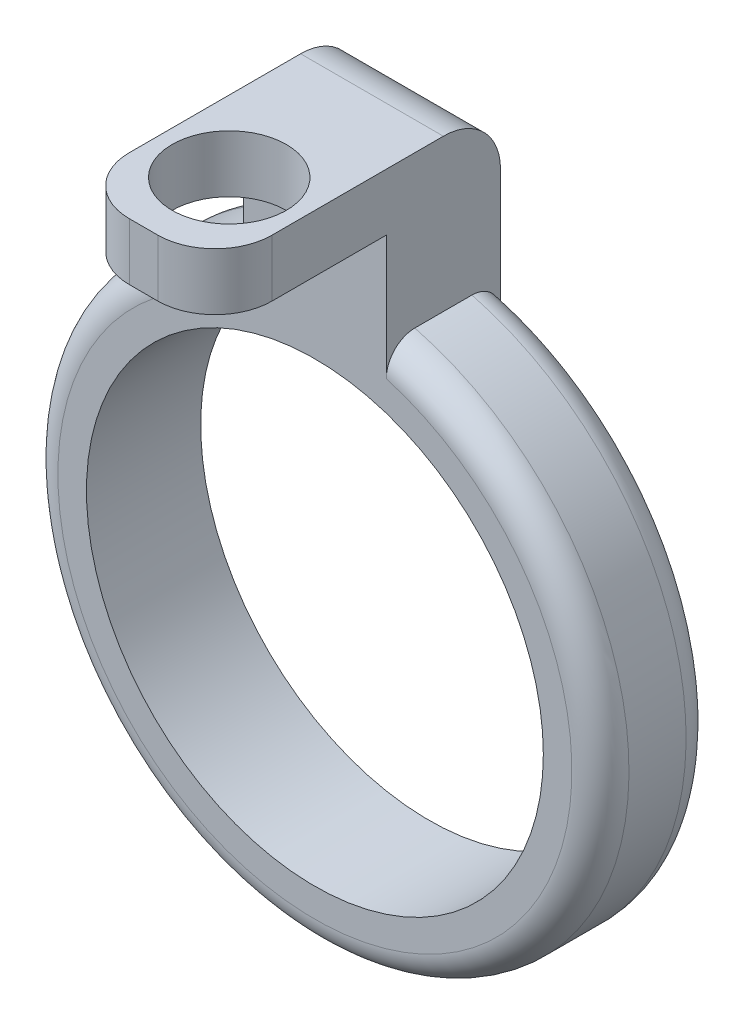
ISO-10303-21;
HEADER;
FILE_DESCRIPTION(('STEP AP214'),'2;1');
FILE_NAME('part.step','',(''),(''),'','','');
FILE_SCHEMA(('AUTOMOTIVE_DESIGN { 1 0 10303 214 1 1 1 1 }'));
ENDSEC;
DATA;
#1=APPLICATION_CONTEXT('core data for automotive mechanical design processes');
#2=APPLICATION_PROTOCOL_DEFINITION('international standard','automotive_design',2000,#1);
#3=PRODUCT_CONTEXT('',#1,'mechanical');
#4=PRODUCT('Part','Part','',(#3));
#5=PRODUCT_RELATED_PRODUCT_CATEGORY('part','',(#4));
#6=PRODUCT_DEFINITION_FORMATION('','',#4);
#7=PRODUCT_DEFINITION_CONTEXT('part definition',#1,'design');
#8=PRODUCT_DEFINITION('design','',#6,#7);
#9=PRODUCT_DEFINITION_SHAPE('','',#8);
#10=(LENGTH_UNIT() NAMED_UNIT(*) SI_UNIT(.MILLI.,.METRE.));
#11=(NAMED_UNIT(*) PLANE_ANGLE_UNIT() SI_UNIT($,.RADIAN.));
#12=(NAMED_UNIT(*) SI_UNIT($,.STERADIAN.) SOLID_ANGLE_UNIT());
#13=UNCERTAINTY_MEASURE_WITH_UNIT(LENGTH_MEASURE(1.E-05),#10,'distance_accuracy_value','');
#14=(GEOMETRIC_REPRESENTATION_CONTEXT(3) GLOBAL_UNCERTAINTY_ASSIGNED_CONTEXT((#13)) GLOBAL_UNIT_ASSIGNED_CONTEXT((#10,
#11,#12)) REPRESENTATION_CONTEXT('',''));
#15=CARTESIAN_POINT('',(0.,0.,0.));
#16=DIRECTION('',(0.,0.,1.));
#17=DIRECTION('',(1.,0.,0.));
#18=AXIS2_PLACEMENT_3D('',#15,#16,#17);
#19=CARTESIAN_POINT('',(-261.777043848484,-270.,10.));
#20=DIRECTION('',(0.,0.,-1.));
#21=DIRECTION('',(-1.,0.,0.));
#22=AXIS2_PLACEMENT_3D('',#19,#20,#21);
#23=CYLINDRICAL_SURFACE('',#22,50.);
#24=DIRECTION('',(0.,0.,-1.));
#25=VECTOR('',#24,1.);
#26=CARTESIAN_POINT('',(-274.277043848484,-221.587708172407,10.));
#27=LINE('',#26,#25);
#28=CARTESIAN_POINT('',(-274.277043848484,-221.587708172407,5.));
#29=VERTEX_POINT('',#28);
#30=CARTESIAN_POINT('',(-274.277043848484,-221.587708172407,-5.));
#31=VERTEX_POINT('',#30);
#32=EDGE_CURVE('E161',#29,#31,#27,.T.);
#33=ORIENTED_EDGE('',*,*,#32,.T.);
#34=CARTESIAN_POINT('',(-261.777043848484,-270.,-5.));
#35=DIRECTION('',(0.,0.,1.));
#36=DIRECTION('',(1.,0.,0.));
#37=AXIS2_PLACEMENT_3D('',#34,#35,#36);
#38=CIRCLE('',#37,50.);
#39=CARTESIAN_POINT('',(-249.277043848484,-221.587708172407,-5.));
#40=VERTEX_POINT('',#39);
#41=EDGE_CURVE('E205',#31,#40,#38,.T.);
#42=ORIENTED_EDGE('',*,*,#41,.T.);
#43=DIRECTION('',(0.,0.,-1.));
#44=VECTOR('',#43,1.);
#45=CARTESIAN_POINT('',(-249.277043848484,-221.587708172407,10.));
#46=LINE('',#45,#44);
#47=CARTESIAN_POINT('',(-249.277043848484,-221.587708172407,5.));
#48=VERTEX_POINT('',#47);
#49=EDGE_CURVE('E160',#40,#48,#46,.F.);
#50=ORIENTED_EDGE('',*,*,#49,.T.);
#51=CARTESIAN_POINT('',(-261.777043848484,-270.,5.));
#52=DIRECTION('',(0.,0.,1.));
#53=DIRECTION('',(1.,0.,0.));
#54=AXIS2_PLACEMENT_3D('',#51,#52,#53);
#55=CIRCLE('',#54,50.);
#56=EDGE_CURVE('E203',#48,#29,#55,.F.);
#57=ORIENTED_EDGE('',*,*,#56,.T.);
#58=EDGE_LOOP('',(#33,#42,#50,#57));
#59=FACE_BOUND('',#58,.T.);
#60=ADVANCED_FACE('F34',(#59),#23,.T.);
#61=CARTESIAN_POINT('',(-261.777043848484,-270.,10.));
#62=DIRECTION('',(0.,0.,1.));
#63=DIRECTION('',(1.,0.,0.));
#64=AXIS2_PLACEMENT_3D('',#61,#62,#63);
#65=PLANE('',#64);
#66=CARTESIAN_POINT('',(-261.777043848484,-270.,10.));
#67=DIRECTION('',(0.,0.,1.));
#68=DIRECTION('',(1.,0.,0.));
#69=AXIS2_PLACEMENT_3D('',#66,#67,#68);
#70=CIRCLE('',#69,45.);
#71=CARTESIAN_POINT('',(-274.277043848484,-226.770958835524,10.));
#72=VERTEX_POINT('',#71);
#73=CARTESIAN_POINT('',(-249.277043848484,-226.770958835524,10.));
#74=VERTEX_POINT('',#73);
#75=EDGE_CURVE('E138',#72,#74,#70,.T.);
#76=ORIENTED_EDGE('',*,*,#75,.T.);
#77=DIRECTION('',(0.,1.,0.));
#78=VECTOR('',#77,1.);
#79=CARTESIAN_POINT('',(-249.277043848484,-320.002,10.));
#80=LINE('',#79,#78);
#81=CARTESIAN_POINT('',(-249.277043848484,-205.,10.));
#82=VERTEX_POINT('',#81);
#83=EDGE_CURVE('E55',#74,#82,#80,.T.);
#84=ORIENTED_EDGE('',*,*,#83,.T.);
#85=DIRECTION('',(1.,0.,0.));
#86=VECTOR('',#85,1.);
#87=CARTESIAN_POINT('',(-274.277043848484,-205.,10.));
#88=LINE('',#87,#86);
#89=CARTESIAN_POINT('',(-274.277043848484,-205.,10.));
#90=VERTEX_POINT('',#89);
#91=EDGE_CURVE('E136',#90,#82,#88,.T.);
#92=ORIENTED_EDGE('',*,*,#91,.F.);
#93=DIRECTION('',(0.,1.,0.));
#94=VECTOR('',#93,1.);
#95=CARTESIAN_POINT('',(-274.277043848484,-320.002,10.));
#96=LINE('',#95,#94);
#97=EDGE_CURVE('E63',#72,#90,#96,.T.);
#98=ORIENTED_EDGE('',*,*,#97,.F.);
#99=EDGE_LOOP('',(#76,#84,#92,#98));
#100=FACE_BOUND('',#99,.T.);
#101=CARTESIAN_POINT('',(-261.777043848484,-270.,10.));
#102=DIRECTION('',(0.,0.,1.));
#103=DIRECTION('',(1.,0.,0.));
#104=AXIS2_PLACEMENT_3D('',#101,#102,#103);
#105=CIRCLE('',#104,40.);
#106=CARTESIAN_POINT('',(-221.777043848485,-270.,10.));
#107=VERTEX_POINT('',#106);
#108=EDGE_CURVE('E172',#107,#107,#105,.T.);
#109=ORIENTED_EDGE('',*,*,#108,.F.);
#110=EDGE_LOOP('',(#109));
#111=FACE_BOUND('',#110,.T.);
#112=ADVANCED_FACE('F134',(#100,#111),#65,.T.);
#113=CARTESIAN_POINT('',(-261.777043848484,-270.,-10.));
#114=DIRECTION('',(0.,0.,1.));
#115=DIRECTION('',(1.,0.,0.));
#116=AXIS2_PLACEMENT_3D('',#113,#114,#115);
#117=PLANE('',#116);
#118=DIRECTION('',(0.,1.,0.));
#119=VECTOR('',#118,1.);
#120=CARTESIAN_POINT('',(-249.277043848484,-320.002,-10.));
#121=LINE('',#120,#119);
#122=CARTESIAN_POINT('',(-249.277043848484,-226.770958835524,-10.));
#123=VERTEX_POINT('',#122);
#124=CARTESIAN_POINT('',(-249.277043848484,-205.,-10.));
#125=VERTEX_POINT('',#124);
#126=EDGE_CURVE('E139',#123,#125,#121,.T.);
#127=ORIENTED_EDGE('',*,*,#126,.F.);
#128=CARTESIAN_POINT('',(-261.777043848484,-270.,-10.));
#129=DIRECTION('',(0.,0.,1.));
#130=DIRECTION('',(1.,0.,0.));
#131=AXIS2_PLACEMENT_3D('',#128,#129,#130);
#132=CIRCLE('',#131,45.);
#133=CARTESIAN_POINT('',(-274.277043848484,-226.770958835524,-10.));
#134=VERTEX_POINT('',#133);
#135=EDGE_CURVE('E208',#123,#134,#132,.F.);
#136=ORIENTED_EDGE('',*,*,#135,.T.);
#137=DIRECTION('',(0.,1.,0.));
#138=VECTOR('',#137,1.);
#139=CARTESIAN_POINT('',(-274.277043848484,-320.002,-10.));
#140=LINE('',#139,#138);
#141=CARTESIAN_POINT('',(-274.277043848484,-205.,-10.));
#142=VERTEX_POINT('',#141);
#143=EDGE_CURVE('E164',#134,#142,#140,.T.);
#144=ORIENTED_EDGE('',*,*,#143,.T.);
#145=DIRECTION('',(-1.,0.,0.));
#146=VECTOR('',#145,1.);
#147=CARTESIAN_POINT('',(-261.777043848484,-205.,-10.));
#148=LINE('',#147,#146);
#149=EDGE_CURVE('E199',#142,#125,#148,.F.);
#150=ORIENTED_EDGE('',*,*,#149,.T.);
#151=EDGE_LOOP('',(#127,#136,#144,#150));
#152=FACE_BOUND('',#151,.T.);
#153=CARTESIAN_POINT('',(-261.777043848484,-270.,-10.));
#154=DIRECTION('',(0.,0.,1.));
#155=DIRECTION('',(1.,0.,0.));
#156=AXIS2_PLACEMENT_3D('',#153,#154,#155);
#157=CIRCLE('',#156,40.);
#158=CARTESIAN_POINT('',(-221.777043848485,-270.,-10.));
#159=VERTEX_POINT('',#158);
#160=EDGE_CURVE('E167',#159,#159,#157,.T.);
#161=ORIENTED_EDGE('',*,*,#160,.T.);
#162=EDGE_LOOP('',(#161));
#163=FACE_BOUND('',#162,.T.);
#164=ADVANCED_FACE('F249',(#152,#163),#117,.F.);
#165=CARTESIAN_POINT('',(-261.777043848484,-270.,10.));
#166=DIRECTION('',(0.,0.,-1.));
#167=DIRECTION('',(-1.,0.,0.));
#168=AXIS2_PLACEMENT_3D('',#165,#166,#167);
#169=CYLINDRICAL_SURFACE('',#168,40.);
#170=ORIENTED_EDGE('',*,*,#108,.T.);
#171=EDGE_LOOP('',(#170));
#172=FACE_BOUND('',#171,.T.);
#173=ORIENTED_EDGE('',*,*,#160,.F.);
#174=EDGE_LOOP('',(#173));
#175=FACE_BOUND('',#174,.T.);
#176=ADVANCED_FACE('F252',(#172,#175),#169,.F.);
#177=CARTESIAN_POINT('',(-274.277043848484,-320.002,10.));
#178=DIRECTION('',(1.,0.,0.));
#179=DIRECTION('',(0.,0.,-1.));
#180=AXIS2_PLACEMENT_3D('',#177,#178,#179);
#181=PLANE('',#180);
#182=DIRECTION('',(0.,0.,-1.));
#183=VECTOR('',#182,1.);
#184=CARTESIAN_POINT('',(-274.277043848484,-195.,10.));
#185=LINE('',#184,#183);
#186=CARTESIAN_POINT('',(-274.277043848484,-195.,30.));
#187=VERTEX_POINT('',#186);
#188=CARTESIAN_POINT('',(-274.277043848484,-195.,0.));
#189=VERTEX_POINT('',#188);
#190=EDGE_CURVE('E154',#187,#189,#185,.T.);
#191=ORIENTED_EDGE('',*,*,#190,.T.);
#192=CARTESIAN_POINT('',(-274.277043848484,-205.,0.));
#193=DIRECTION('',(1.,0.,0.));
#194=DIRECTION('',(0.,0.,-1.));
#195=AXIS2_PLACEMENT_3D('',#192,#193,#194);
#196=CIRCLE('',#195,10.);
#197=EDGE_CURVE('E197',#189,#142,#196,.F.);
#198=ORIENTED_EDGE('',*,*,#197,.T.);
#199=ORIENTED_EDGE('',*,*,#143,.F.);
#200=CARTESIAN_POINT('',(-274.277043848484,-226.770958835524,-10.));
#201=CARTESIAN_POINT('',(-274.277043848484,-226.620904663892,-10.0000123629312));
#202=CARTESIAN_POINT('',(-274.277043848484,-226.470848015885,-9.99376678782601));
#203=CARTESIAN_POINT('',(-274.277043848484,-226.171764349509,-9.96881621454655));
#204=CARTESIAN_POINT('',(-274.277043848484,-226.022737401482,-9.95011037350338));
#205=CARTESIAN_POINT('',(-274.277043848484,-225.726687106017,-9.90028206885406));
#206=CARTESIAN_POINT('',(-274.277043848484,-225.579664902791,-9.8691527980645));
#207=CARTESIAN_POINT('',(-274.277043848484,-225.288766683154,-9.79462849887413));
#208=CARTESIAN_POINT('',(-274.277043848484,-225.144890546118,-9.75123394163978));
#209=CARTESIAN_POINT('',(-274.277043848484,-224.861203047477,-9.65235599824471));
#210=CARTESIAN_POINT('',(-274.277043848484,-224.72139552937,-9.59686157666914));
#211=CARTESIAN_POINT('',(-274.277043848484,-224.446986159387,-9.47409261764547));
#212=CARTESIAN_POINT('',(-274.277043848484,-224.312386261757,-9.40681370922689));
#213=CARTESIAN_POINT('',(-274.277043848484,-224.049613592405,-9.26095438256462));
#214=CARTESIAN_POINT('',(-274.277043848484,-223.921435056345,-9.18238435452229));
#215=CARTESIAN_POINT('',(-274.277043848484,-223.672355899733,-9.01435744822176));
#216=CARTESIAN_POINT('',(-274.277043848484,-223.551457731554,-8.92489693185416));
#217=CARTESIAN_POINT('',(-274.277043848484,-223.320613796951,-8.73782829441376));
#218=CARTESIAN_POINT('',(-274.277043848484,-223.210482860775,-8.64044866330674));
#219=CARTESIAN_POINT('',(-274.277043848484,-222.999074863072,-8.43651289266242));
#220=CARTESIAN_POINT('',(-274.277043848484,-222.897797467639,-8.32995709949943));
#221=CARTESIAN_POINT('',(-274.277043848484,-222.704906392495,-8.10835622440978));
#222=CARTESIAN_POINT('',(-274.277043848484,-222.613296403198,-7.99330792885131));
#223=CARTESIAN_POINT('',(-274.277043848484,-222.440609934638,-7.75562626466323));
#224=CARTESIAN_POINT('',(-274.277043848484,-222.359529199465,-7.63299599042976));
#225=CARTESIAN_POINT('',(-274.277043848484,-222.211158895173,-7.38532729359709));
#226=CARTESIAN_POINT('',(-274.277043848484,-222.143492736067,-7.26051435854181));
#227=CARTESIAN_POINT('',(-274.277043848484,-222.019214133688,-7.00556283320292));
#228=CARTESIAN_POINT('',(-274.277043848484,-221.96259706168,-6.87542650077899));
#229=CARTESIAN_POINT('',(-274.277043848484,-221.86090634599,-6.61081937581882));
#230=CARTESIAN_POINT('',(-274.277043848484,-221.815824807261,-6.47635161910488));
#231=CARTESIAN_POINT('',(-274.277043848484,-221.737560494707,-6.20404802781928));
#232=CARTESIAN_POINT('',(-274.277043848484,-221.704373721524,-6.0662133419859));
#233=CARTESIAN_POINT('',(-274.277043848484,-221.647509320452,-5.77445687179071));
#234=CARTESIAN_POINT('',(-274.277043848484,-221.62509072813,-5.62028808961101));
#235=CARTESIAN_POINT('',(-274.277043848484,-221.595186158867,-5.31074427626928));
#236=CARTESIAN_POINT('',(-274.277043848484,-221.587677786094,-5.15537140667756));
#237=CARTESIAN_POINT('',(-274.277043848484,-221.587708172407,-5.));
#238=B_SPLINE_CURVE_WITH_KNOTS('',3,(#200,#201,#202,#203,#204,#205,#206,#207,#208,#209,#210,
#211,#212,#213,#214,#215,#216,#217,#218,#219,#220,#221,#222,#223,#224,#225,#226,#227,#228,#229,
#230,#231,#232,#233,#234,#235,#236,#237),.UNSPECIFIED.,.F.,.F.,(4,2,2,2,2,2,2,2,2,2,2,2,2,2,2,2,
2,2,4),(0.,0.45003661129417,0.900103668196331,1.35041767015454,1.80071437581713,
2.25142349544465,2.70230014244495,3.15276451387569,3.60337978388954,4.04386067213448,
4.48432494074673,4.92495674758407,5.36540989362728,5.79081196501007,6.21603544057232,
6.64096710532153,7.06575576164649,7.53239664599153,7.998336082609),.UNSPECIFIED.);
#239=EDGE_CURVE('E220',#134,#31,#238,.T.);
#240=ORIENTED_EDGE('',*,*,#239,.T.);
#241=ORIENTED_EDGE('',*,*,#32,.F.);
#242=CARTESIAN_POINT('',(-274.277043848484,-221.587708172407,5.));
#243=CARTESIAN_POINT('',(-274.277043848484,-221.587690586362,5.13729675775235));
#244=CARTESIAN_POINT('',(-274.277043848484,-221.593547989034,5.27458987833961));
#245=CARTESIAN_POINT('',(-274.277043848484,-221.616884884961,5.5481707305229));
#246=CARTESIAN_POINT('',(-274.277043848484,-221.63436314648,5.68445856712467));
#247=CARTESIAN_POINT('',(-274.277043848484,-221.68077725686,5.95484665141164));
#248=CARTESIAN_POINT('',(-274.277043848484,-221.709694973792,6.08895001301598));
#249=CARTESIAN_POINT('',(-274.277043848484,-221.778741955461,6.35423722946202));
#250=CARTESIAN_POINT('',(-274.277043848484,-221.818871206106,6.48542108797279));
#251=CARTESIAN_POINT('',(-274.277043848484,-221.910012145296,6.74395043268843));
#252=CARTESIAN_POINT('',(-274.277043848484,-221.961023805999,6.87129592871274));
#253=CARTESIAN_POINT('',(-274.277043848484,-222.073536156159,7.12132035364506));
#254=CARTESIAN_POINT('',(-274.277043848484,-222.135040711708,7.24399754207298));
#255=CARTESIAN_POINT('',(-274.277043848484,-222.268013149343,7.48377128013589));
#256=CARTESIAN_POINT('',(-274.277043848484,-222.339477659604,7.60086970047052));
#257=CARTESIAN_POINT('',(-274.277043848484,-222.491856373261,7.82880786141955));
#258=CARTESIAN_POINT('',(-274.277043848484,-222.572774100626,7.93964524505741));
#259=CARTESIAN_POINT('',(-274.277043848484,-222.744477756873,8.15564122357053));
#260=CARTESIAN_POINT('',(-274.277043848484,-222.835373376966,8.2607126082619));
#261=CARTESIAN_POINT('',(-274.277043848484,-223.025538312018,8.46305136384076));
#262=CARTESIAN_POINT('',(-274.277043848484,-223.124810695335,8.56031584942928));
#263=CARTESIAN_POINT('',(-274.277043848484,-223.330946201571,8.74639459712264));
#264=CARTESIAN_POINT('',(-274.277043848484,-223.437807932216,8.83521040218872));
#265=CARTESIAN_POINT('',(-274.277043848484,-223.658407878079,9.0039284824075));
#266=CARTESIAN_POINT('',(-274.277043848484,-223.77214859515,9.08382748413768));
#267=CARTESIAN_POINT('',(-274.277043848484,-224.009187123944,9.23649343736299));
#268=CARTESIAN_POINT('',(-274.277043848484,-224.132669373908,9.30897411588191));
#269=CARTESIAN_POINT('',(-274.277043848484,-224.38520788375,9.44359112341645));
#270=CARTESIAN_POINT('',(-274.277043848484,-224.51426640178,9.50572321129771));
#271=CARTESIAN_POINT('',(-274.277043848484,-224.776968709308,9.6192587195422));
#272=CARTESIAN_POINT('',(-274.277043848484,-224.910610808854,9.67066604561545));
#273=CARTESIAN_POINT('',(-274.277043848484,-225.181608435754,9.76253009037664));
#274=CARTESIAN_POINT('',(-274.277043848484,-225.318964762028,9.8029844321643));
#275=CARTESIAN_POINT('',(-274.277043848484,-225.672322970658,9.89178754374983));
#276=CARTESIAN_POINT('',(-274.277043848484,-225.890342353275,9.93239937520035));
#277=CARTESIAN_POINT('',(-274.277043848484,-226.219542548976,9.97297463722669));
#278=CARTESIAN_POINT('',(-274.277043848484,-226.329583493093,9.98310931855165));
#279=CARTESIAN_POINT('',(-274.277043848484,-226.550057486936,9.99661990582706));
#280=CARTESIAN_POINT('',(-274.277043848484,-226.660490453011,9.99999717595523));
#281=CARTESIAN_POINT('',(-274.277043848484,-226.770958835524,10.));
#282=B_SPLINE_CURVE_WITH_KNOTS('',3,(#242,#243,#244,#245,#246,#247,#248,#249,#250,#251,#252,
#253,#254,#255,#256,#257,#258,#259,#260,#261,#262,#263,#264,#265,#266,#267,#268,#269,#270,#271,
#272,#273,#274,#275,#276,#277,#278,#279,#280,#281),.UNSPECIFIED.,.F.,.F.,(4,2,2,2,2,2,2,2,2,2,2,
2,2,2,2,2,2,2,2,4),(0.,0.411759978423581,0.823476319933891,1.23454267505452,1.64560851353735,
2.05667330032632,2.46788987168134,2.87896756710716,3.29019899594356,3.70651753209085,
4.12298923081518,4.53938472374969,4.95593257908845,5.38499092070244,5.81422467173903,
6.24330183185171,6.67247203123536,7.3358178031381,7.66716697681501,7.99844925138382),.UNSPECIFIED.);
#283=EDGE_CURVE('E11',#29,#72,#282,.T.);
#284=ORIENTED_EDGE('',*,*,#283,.T.);
#285=ORIENTED_EDGE('',*,*,#97,.T.);
#286=DIRECTION('',(0.,0.,-1.));
#287=VECTOR('',#286,1.);
#288=CARTESIAN_POINT('',(-274.277043848484,-205.,40.));
#289=LINE('',#288,#287);
#290=CARTESIAN_POINT('',(-274.277043848484,-205.,30.));
#291=VERTEX_POINT('',#290);
#292=EDGE_CURVE('E131',#291,#90,#289,.T.);
#293=ORIENTED_EDGE('',*,*,#292,.F.);
#294=DIRECTION('',(0.,-1.,0.));
#295=VECTOR('',#294,1.);
#296=CARTESIAN_POINT('',(-274.277043848484,-195.,30.));
#297=LINE('',#296,#295);
#298=EDGE_CURVE('E192',#291,#187,#297,.F.);
#299=ORIENTED_EDGE('',*,*,#298,.T.);
#300=EDGE_LOOP('',(#191,#198,#199,#240,#241,#284,#285,#293,#299));
#301=FACE_BOUND('',#300,.T.);
#302=ADVANCED_FACE('F256',(#301),#181,.F.);
#303=CARTESIAN_POINT('',(-249.277043848484,-320.002,-10.));
#304=DIRECTION('',(-1.,0.,0.));
#305=DIRECTION('',(0.,0.,1.));
#306=AXIS2_PLACEMENT_3D('',#303,#304,#305);
#307=PLANE('',#306);
#308=ORIENTED_EDGE('',*,*,#126,.T.);
#309=CARTESIAN_POINT('',(-249.277043848484,-205.,0.));
#310=DIRECTION('',(-1.,0.,0.));
#311=DIRECTION('',(0.,0.,1.));
#312=AXIS2_PLACEMENT_3D('',#309,#310,#311);
#313=CIRCLE('',#312,10.);
#314=CARTESIAN_POINT('',(-249.277043848484,-195.,0.));
#315=VERTEX_POINT('',#314);
#316=EDGE_CURVE('E201',#125,#315,#313,.F.);
#317=ORIENTED_EDGE('',*,*,#316,.T.);
#318=DIRECTION('',(0.,0.,-1.));
#319=VECTOR('',#318,1.);
#320=CARTESIAN_POINT('',(-249.277043848484,-195.,10.));
#321=LINE('',#320,#319);
#322=CARTESIAN_POINT('',(-249.277043848484,-195.,30.));
#323=VERTEX_POINT('',#322);
#324=EDGE_CURVE('E157',#323,#315,#321,.T.);
#325=ORIENTED_EDGE('',*,*,#324,.F.);
#326=DIRECTION('',(0.,1.,0.));
#327=VECTOR('',#326,1.);
#328=CARTESIAN_POINT('',(-249.277043848484,-205.,30.));
#329=LINE('',#328,#327);
#330=CARTESIAN_POINT('',(-249.277043848484,-205.,30.));
#331=VERTEX_POINT('',#330);
#332=EDGE_CURVE('E127',#323,#331,#329,.F.);
#333=ORIENTED_EDGE('',*,*,#332,.T.);
#334=DIRECTION('',(0.,0.,-1.));
#335=VECTOR('',#334,1.);
#336=CARTESIAN_POINT('',(-249.277043848484,-205.,40.));
#337=LINE('',#336,#335);
#338=EDGE_CURVE('E122',#331,#82,#337,.T.);
#339=ORIENTED_EDGE('',*,*,#338,.T.);
#340=ORIENTED_EDGE('',*,*,#83,.F.);
#341=CARTESIAN_POINT('',(-249.277043848484,-226.770958835524,10.));
#342=CARTESIAN_POINT('',(-249.277043848484,-226.620904663892,10.0000123629312));
#343=CARTESIAN_POINT('',(-249.277043848484,-226.470848015885,9.99376678782601));
#344=CARTESIAN_POINT('',(-249.277043848484,-226.171764349509,9.96881621454656));
#345=CARTESIAN_POINT('',(-249.277043848484,-226.022737401482,9.95011037350338));
#346=CARTESIAN_POINT('',(-249.277043848484,-225.726687106017,9.90028206885406));
#347=CARTESIAN_POINT('',(-249.277043848484,-225.579664902791,9.8691527980645));
#348=CARTESIAN_POINT('',(-249.277043848484,-225.288766683154,9.79462849887413));
#349=CARTESIAN_POINT('',(-249.277043848484,-225.144890546118,9.75123394163978));
#350=CARTESIAN_POINT('',(-249.277043848484,-224.861203047477,9.65235599824471));
#351=CARTESIAN_POINT('',(-249.277043848484,-224.72139552937,9.59686157666915));
#352=CARTESIAN_POINT('',(-249.277043848484,-224.446986159387,9.47409261764548));
#353=CARTESIAN_POINT('',(-249.277043848484,-224.312386261757,9.4068137092269));
#354=CARTESIAN_POINT('',(-249.277043848484,-224.049613592405,9.26095438256462));
#355=CARTESIAN_POINT('',(-249.277043848484,-223.921435056345,9.18238435452229));
#356=CARTESIAN_POINT('',(-249.277043848484,-223.672355899733,9.01435744822176));
#357=CARTESIAN_POINT('',(-249.277043848484,-223.551457731554,8.92489693185416));
#358=CARTESIAN_POINT('',(-249.277043848484,-223.320613796951,8.73782829441376));
#359=CARTESIAN_POINT('',(-249.277043848484,-223.210482860775,8.64044866330674));
#360=CARTESIAN_POINT('',(-249.277043848484,-222.999074863072,8.43651289266242));
#361=CARTESIAN_POINT('',(-249.277043848484,-222.897797467639,8.32995709949943));
#362=CARTESIAN_POINT('',(-249.277043848484,-222.704906392495,8.10835622440978));
#363=CARTESIAN_POINT('',(-249.277043848484,-222.613296403198,7.99330792885131));
#364=CARTESIAN_POINT('',(-249.277043848484,-222.440609934638,7.75562626466323));
#365=CARTESIAN_POINT('',(-249.277043848484,-222.359529199465,7.63299599042976));
#366=CARTESIAN_POINT('',(-249.277043848484,-222.211158895173,7.38532729359709));
#367=CARTESIAN_POINT('',(-249.277043848484,-222.143492736067,7.26051435854182));
#368=CARTESIAN_POINT('',(-249.277043848484,-222.019214133688,7.00556283320292));
#369=CARTESIAN_POINT('',(-249.277043848484,-221.96259706168,6.87542650077899));
#370=CARTESIAN_POINT('',(-249.277043848484,-221.86090634599,6.61081937581882));
#371=CARTESIAN_POINT('',(-249.277043848484,-221.815824807261,6.47635161910488));
#372=CARTESIAN_POINT('',(-249.277043848484,-221.737560494707,6.20404802781928));
#373=CARTESIAN_POINT('',(-249.277043848484,-221.704373721524,6.0662133419859));
#374=CARTESIAN_POINT('',(-249.277043848484,-221.647509320452,5.77445687179071));
#375=CARTESIAN_POINT('',(-249.277043848484,-221.62509072813,5.62028808961101));
#376=CARTESIAN_POINT('',(-249.277043848484,-221.595186158867,5.31074427626928));
#377=CARTESIAN_POINT('',(-249.277043848484,-221.587677786094,5.15537140667756));
#378=CARTESIAN_POINT('',(-249.277043848484,-221.587708172407,5.));
#379=B_SPLINE_CURVE_WITH_KNOTS('',3,(#341,#342,#343,#344,#345,#346,#347,#348,#349,#350,#351,
#352,#353,#354,#355,#356,#357,#358,#359,#360,#361,#362,#363,#364,#365,#366,#367,#368,#369,#370,
#371,#372,#373,#374,#375,#376,#377,#378),.UNSPECIFIED.,.F.,.F.,(4,2,2,2,2,2,2,2,2,2,2,2,2,2,2,2,
2,2,4),(0.,0.45003661129417,0.900103668196331,1.35041767015454,1.80071437581713,
2.25142349544462,2.70230014244495,3.15276451387569,3.60337978388954,4.04386067213448,
4.48432494074673,4.92495674758407,5.36540989362728,5.79081196501006,6.21603544057232,
6.64096710532153,7.06575576164649,7.53239664599153,7.99833608260899),.UNSPECIFIED.);
#380=EDGE_CURVE('E48',#74,#48,#379,.T.);
#381=ORIENTED_EDGE('',*,*,#380,.T.);
#382=ORIENTED_EDGE('',*,*,#49,.F.);
#383=CARTESIAN_POINT('',(-249.277043848484,-221.587708172407,-5.));
#384=CARTESIAN_POINT('',(-249.277043848484,-221.587690586362,-5.13729675775235));
#385=CARTESIAN_POINT('',(-249.277043848484,-221.593547989034,-5.27458987833961));
#386=CARTESIAN_POINT('',(-249.277043848484,-221.616884884961,-5.5481707305229));
#387=CARTESIAN_POINT('',(-249.277043848484,-221.63436314648,-5.68445856712466));
#388=CARTESIAN_POINT('',(-249.277043848484,-221.68077725686,-5.95484665141164));
#389=CARTESIAN_POINT('',(-249.277043848484,-221.709694973792,-6.08895001301598));
#390=CARTESIAN_POINT('',(-249.277043848484,-221.778741955461,-6.35423722946202));
#391=CARTESIAN_POINT('',(-249.277043848484,-221.818871206106,-6.48542108797279));
#392=CARTESIAN_POINT('',(-249.277043848484,-221.910012145296,-6.74395043268844));
#393=CARTESIAN_POINT('',(-249.277043848484,-221.961023805999,-6.87129592871276));
#394=CARTESIAN_POINT('',(-249.277043848484,-222.073536156159,-7.12132035364508));
#395=CARTESIAN_POINT('',(-249.277043848484,-222.135040711708,-7.243997542073));
#396=CARTESIAN_POINT('',(-249.277043848484,-222.268013149343,-7.4837712801359));
#397=CARTESIAN_POINT('',(-249.277043848484,-222.339477659604,-7.60086970047053));
#398=CARTESIAN_POINT('',(-249.277043848484,-222.491856373261,-7.82880786141955));
#399=CARTESIAN_POINT('',(-249.277043848484,-222.572774100626,-7.93964524505741));
#400=CARTESIAN_POINT('',(-249.277043848484,-222.744477756873,-8.15564122357052));
#401=CARTESIAN_POINT('',(-249.277043848484,-222.835373376966,-8.2607126082619));
#402=CARTESIAN_POINT('',(-249.277043848484,-223.025538312018,-8.46305136384076));
#403=CARTESIAN_POINT('',(-249.277043848484,-223.124810695335,-8.56031584942928));
#404=CARTESIAN_POINT('',(-249.277043848484,-223.330946201571,-8.74639459712263));
#405=CARTESIAN_POINT('',(-249.277043848484,-223.437807932216,-8.8352104021887));
#406=CARTESIAN_POINT('',(-249.277043848484,-223.658407878079,-9.00392848240748));
#407=CARTESIAN_POINT('',(-249.277043848484,-223.77214859515,-9.08382748413766));
#408=CARTESIAN_POINT('',(-249.277043848484,-224.009187123944,-9.23649343736299));
#409=CARTESIAN_POINT('',(-249.277043848484,-224.132669373908,-9.30897411588191));
#410=CARTESIAN_POINT('',(-249.277043848484,-224.38520788375,-9.44359112341646));
#411=CARTESIAN_POINT('',(-249.277043848484,-224.51426640178,-9.50572321129772));
#412=CARTESIAN_POINT('',(-249.277043848484,-224.776968709308,-9.6192587195422));
#413=CARTESIAN_POINT('',(-249.277043848484,-224.910610808854,-9.67066604561544));
#414=CARTESIAN_POINT('',(-249.277043848484,-225.181608435754,-9.76253009037664));
#415=CARTESIAN_POINT('',(-249.277043848484,-225.318964762028,-9.8029844321643));
#416=CARTESIAN_POINT('',(-249.277043848484,-225.672322970658,-9.89178754374983));
#417=CARTESIAN_POINT('',(-249.277043848484,-225.890342353275,-9.93239937520036));
#418=CARTESIAN_POINT('',(-249.277043848484,-226.219542548976,-9.97297463722669));
#419=CARTESIAN_POINT('',(-249.277043848484,-226.329583493093,-9.98310931855164));
#420=CARTESIAN_POINT('',(-249.277043848484,-226.550057486936,-9.99661990582706));
#421=CARTESIAN_POINT('',(-249.277043848484,-226.660490453011,-9.99999717595523));
#422=CARTESIAN_POINT('',(-249.277043848484,-226.770958835524,-10.));
#423=B_SPLINE_CURVE_WITH_KNOTS('',3,(#383,#384,#385,#386,#387,#388,#389,#390,#391,#392,#393,
#394,#395,#396,#397,#398,#399,#400,#401,#402,#403,#404,#405,#406,#407,#408,#409,#410,#411,#412,
#413,#414,#415,#416,#417,#418,#419,#420,#421,#422),.UNSPECIFIED.,.F.,.F.,(4,2,2,2,2,2,2,2,2,2,2,
2,2,2,2,2,2,2,2,4),(0.,0.411759978423578,0.823476319933893,1.23454267505453,1.64560851353735,
2.05667330032635,2.46788987168138,2.87896756710716,3.29019899594356,3.70651753209085,
4.12298923081517,4.53938472374965,4.95593257908844,5.38499092070244,5.81422467173906,
6.24330183185168,6.67247203123536,7.3358178031381,7.66716697681501,7.99844925138382),.UNSPECIFIED.);
#424=EDGE_CURVE('E212',#40,#123,#423,.T.);
#425=ORIENTED_EDGE('',*,*,#424,.T.);
#426=EDGE_LOOP('',(#308,#317,#325,#333,#339,#340,#381,#382,#425));
#427=FACE_BOUND('',#426,.T.);
#428=ADVANCED_FACE('F124',(#427),#307,.F.);
#429=CARTESIAN_POINT('',(-274.277043848484,-195.,10.));
#430=DIRECTION('',(0.,-1.,0.));
#431=DIRECTION('',(0.,0.,-1.));
#432=AXIS2_PLACEMENT_3D('',#429,#430,#431);
#433=PLANE('',#432);
#434=CARTESIAN_POINT('',(-261.777043848484,-195.,25.));
#435=DIRECTION('',(0.,-1.,0.));
#436=DIRECTION('',(0.,0.,-1.));
#437=AXIS2_PLACEMENT_3D('',#434,#435,#436);
#438=CIRCLE('',#437,10.);
#439=CARTESIAN_POINT('',(-261.777043848484,-195.,15.));
#440=VERTEX_POINT('',#439);
#441=EDGE_CURVE('E144',#440,#440,#438,.F.);
#442=ORIENTED_EDGE('',*,*,#441,.F.);
#443=EDGE_LOOP('',(#442));
#444=FACE_BOUND('',#443,.T.);
#445=ORIENTED_EDGE('',*,*,#324,.T.);
#446=DIRECTION('',(-1.,0.,0.));
#447=VECTOR('',#446,1.);
#448=CARTESIAN_POINT('',(-274.277043848484,-195.,0.));
#449=LINE('',#448,#447);
#450=EDGE_CURVE('E194',#315,#189,#449,.T.);
#451=ORIENTED_EDGE('',*,*,#450,.T.);
#452=ORIENTED_EDGE('',*,*,#190,.F.);
#453=CARTESIAN_POINT('',(-264.277043848484,-195.,30.));
#454=DIRECTION('',(0.,-1.,0.));
#455=DIRECTION('',(0.,0.,-1.));
#456=AXIS2_PLACEMENT_3D('',#453,#454,#455);
#457=CIRCLE('',#456,10.);
#458=CARTESIAN_POINT('',(-264.277043848484,-195.,40.));
#459=VERTEX_POINT('',#458);
#460=EDGE_CURVE('E183',#187,#459,#457,.F.);
#461=ORIENTED_EDGE('',*,*,#460,.T.);
#462=DIRECTION('',(-1.,0.,0.));
#463=VECTOR('',#462,1.);
#464=CARTESIAN_POINT('',(-274.277043848484,-195.,40.));
#465=LINE('',#464,#463);
#466=CARTESIAN_POINT('',(-259.277043848484,-195.,40.));
#467=VERTEX_POINT('',#466);
#468=EDGE_CURVE('E132',#467,#459,#465,.T.);
#469=ORIENTED_EDGE('',*,*,#468,.F.);
#470=CARTESIAN_POINT('',(-259.277043848484,-195.,30.));
#471=DIRECTION('',(0.,-1.,0.));
#472=DIRECTION('',(0.,0.,-1.));
#473=AXIS2_PLACEMENT_3D('',#470,#471,#472);
#474=CIRCLE('',#473,10.);
#475=EDGE_CURVE('E185',#467,#323,#474,.F.);
#476=ORIENTED_EDGE('',*,*,#475,.T.);
#477=EDGE_LOOP('',(#445,#451,#452,#461,#469,#476));
#478=FACE_BOUND('',#477,.T.);
#479=ADVANCED_FACE('F262',(#444,#478),#433,.F.);
#480=CARTESIAN_POINT('',(-274.277043848484,-205.,40.));
#481=DIRECTION('',(0.,1.,0.));
#482=DIRECTION('',(0.,0.,1.));
#483=AXIS2_PLACEMENT_3D('',#480,#481,#482);
#484=PLANE('',#483);
#485=CARTESIAN_POINT('',(-261.777043848484,-205.,25.));
#486=DIRECTION('',(0.,-1.,0.));
#487=DIRECTION('',(0.,0.,-1.));
#488=AXIS2_PLACEMENT_3D('',#485,#486,#487);
#489=CIRCLE('',#488,10.);
#490=CARTESIAN_POINT('',(-261.777043848484,-205.,15.));
#491=VERTEX_POINT('',#490);
#492=EDGE_CURVE('E149',#491,#491,#489,.T.);
#493=ORIENTED_EDGE('',*,*,#492,.F.);
#494=EDGE_LOOP('',(#493));
#495=FACE_BOUND('',#494,.T.);
#496=ORIENTED_EDGE('',*,*,#338,.F.);
#497=CARTESIAN_POINT('',(-259.277043848484,-205.,30.));
#498=DIRECTION('',(0.,1.,0.));
#499=DIRECTION('',(0.,0.,1.));
#500=AXIS2_PLACEMENT_3D('',#497,#498,#499);
#501=CIRCLE('',#500,10.);
#502=CARTESIAN_POINT('',(-259.277043848484,-205.,40.));
#503=VERTEX_POINT('',#502);
#504=EDGE_CURVE('E190',#331,#503,#501,.F.);
#505=ORIENTED_EDGE('',*,*,#504,.T.);
#506=DIRECTION('',(1.,0.,0.));
#507=VECTOR('',#506,1.);
#508=CARTESIAN_POINT('',(-274.277043848484,-205.,40.));
#509=LINE('',#508,#507);
#510=CARTESIAN_POINT('',(-264.277043848484,-205.,40.));
#511=VERTEX_POINT('',#510);
#512=EDGE_CURVE('E143',#511,#503,#509,.T.);
#513=ORIENTED_EDGE('',*,*,#512,.F.);
#514=CARTESIAN_POINT('',(-264.277043848484,-205.,30.));
#515=DIRECTION('',(0.,1.,0.));
#516=DIRECTION('',(0.,0.,1.));
#517=AXIS2_PLACEMENT_3D('',#514,#515,#516);
#518=CIRCLE('',#517,10.);
#519=EDGE_CURVE('E188',#511,#291,#518,.F.);
#520=ORIENTED_EDGE('',*,*,#519,.T.);
#521=ORIENTED_EDGE('',*,*,#292,.T.);
#522=ORIENTED_EDGE('',*,*,#91,.T.);
#523=EDGE_LOOP('',(#496,#505,#513,#520,#521,#522));
#524=FACE_BOUND('',#523,.T.);
#525=ADVANCED_FACE('F141',(#495,#524),#484,.F.);
#526=CARTESIAN_POINT('',(0.,0.,40.));
#527=DIRECTION('',(0.,0.,1.));
#528=DIRECTION('',(1.,0.,0.));
#529=AXIS2_PLACEMENT_3D('',#526,#527,#528);
#530=PLANE('',#529);
#531=ORIENTED_EDGE('',*,*,#512,.T.);
#532=DIRECTION('',(0.,1.,0.));
#533=VECTOR('',#532,1.);
#534=CARTESIAN_POINT('',(-259.277043848484,-195.,40.));
#535=LINE('',#534,#533);
#536=EDGE_CURVE('E180',#503,#467,#535,.T.);
#537=ORIENTED_EDGE('',*,*,#536,.T.);
#538=ORIENTED_EDGE('',*,*,#468,.T.);
#539=DIRECTION('',(0.,-1.,0.));
#540=VECTOR('',#539,1.);
#541=CARTESIAN_POINT('',(-264.277043848484,-205.,40.));
#542=LINE('',#541,#540);
#543=EDGE_CURVE('E175',#459,#511,#542,.T.);
#544=ORIENTED_EDGE('',*,*,#543,.T.);
#545=EDGE_LOOP('',(#531,#537,#538,#544));
#546=FACE_BOUND('',#545,.T.);
#547=ADVANCED_FACE('F273',(#546),#530,.T.);
#548=CARTESIAN_POINT('',(-261.777043848484,-194.999,25.));
#549=DIRECTION('',(0.,-1.,0.));
#550=DIRECTION('',(0.,0.,-1.));
#551=AXIS2_PLACEMENT_3D('',#548,#549,#550);
#552=CYLINDRICAL_SURFACE('',#551,10.);
#553=ORIENTED_EDGE('',*,*,#492,.T.);
#554=EDGE_LOOP('',(#553));
#555=FACE_BOUND('',#554,.T.);
#556=ORIENTED_EDGE('',*,*,#441,.T.);
#557=EDGE_LOOP('',(#556));
#558=FACE_BOUND('',#557,.T.);
#559=ADVANCED_FACE('F244',(#555,#558),#552,.F.);
#560=CARTESIAN_POINT('',(-259.277043848484,0.,30.));
#561=DIRECTION('',(0.,-1.,0.));
#562=DIRECTION('',(0.,0.,-1.));
#563=AXIS2_PLACEMENT_3D('',#560,#561,#562);
#564=CYLINDRICAL_SURFACE('',#563,10.);
#565=ORIENTED_EDGE('',*,*,#504,.F.);
#566=ORIENTED_EDGE('',*,*,#332,.F.);
#567=ORIENTED_EDGE('',*,*,#475,.F.);
#568=ORIENTED_EDGE('',*,*,#536,.F.);
#569=EDGE_LOOP('',(#565,#566,#567,#568));
#570=FACE_BOUND('',#569,.T.);
#571=ADVANCED_FACE('F240',(#570),#564,.T.);
#572=CARTESIAN_POINT('',(-264.277043848484,0.,30.));
#573=DIRECTION('',(0.,1.,0.));
#574=DIRECTION('',(0.,0.,1.));
#575=AXIS2_PLACEMENT_3D('',#572,#573,#574);
#576=CYLINDRICAL_SURFACE('',#575,10.);
#577=ORIENTED_EDGE('',*,*,#460,.F.);
#578=ORIENTED_EDGE('',*,*,#298,.F.);
#579=ORIENTED_EDGE('',*,*,#519,.F.);
#580=ORIENTED_EDGE('',*,*,#543,.F.);
#581=EDGE_LOOP('',(#577,#578,#579,#580));
#582=FACE_BOUND('',#581,.T.);
#583=ADVANCED_FACE('F236',(#582),#576,.T.);
#584=CARTESIAN_POINT('',(-274.277043848484,-205.,0.));
#585=DIRECTION('',(-1.,0.,0.));
#586=DIRECTION('',(0.,0.,1.));
#587=AXIS2_PLACEMENT_3D('',#584,#585,#586);
#588=CYLINDRICAL_SURFACE('',#587,10.);
#589=ORIENTED_EDGE('',*,*,#316,.F.);
#590=ORIENTED_EDGE('',*,*,#149,.F.);
#591=ORIENTED_EDGE('',*,*,#197,.F.);
#592=ORIENTED_EDGE('',*,*,#450,.F.);
#593=EDGE_LOOP('',(#589,#590,#591,#592));
#594=FACE_BOUND('',#593,.T.);
#595=ADVANCED_FACE('F231',(#594),#588,.T.);
#596=CARTESIAN_POINT('',(-261.777043848484,-270.,-5.));
#597=DIRECTION('',(0.,0.,1.));
#598=DIRECTION('',(1.,0.,0.));
#599=AXIS2_PLACEMENT_3D('',#596,#597,#598);
#600=TOROIDAL_SURFACE('',#599,45.,5.);
#601=ORIENTED_EDGE('',*,*,#239,.F.);
#602=ORIENTED_EDGE('',*,*,#135,.F.);
#603=ORIENTED_EDGE('',*,*,#424,.F.);
#604=ORIENTED_EDGE('',*,*,#41,.F.);
#605=EDGE_LOOP('',(#601,#602,#603,#604));
#606=FACE_BOUND('',#605,.T.);
#607=ADVANCED_FACE('F227',(#606),#600,.T.);
#608=CARTESIAN_POINT('',(-261.777043848484,-270.,5.));
#609=DIRECTION('',(0.,0.,1.));
#610=DIRECTION('',(1.,0.,0.));
#611=AXIS2_PLACEMENT_3D('',#608,#609,#610);
#612=TOROIDAL_SURFACE('',#611,45.,5.);
#613=ORIENTED_EDGE('',*,*,#283,.F.);
#614=ORIENTED_EDGE('',*,*,#56,.F.);
#615=ORIENTED_EDGE('',*,*,#380,.F.);
#616=ORIENTED_EDGE('',*,*,#75,.F.);
#617=EDGE_LOOP('',(#613,#614,#615,#616));
#618=FACE_BOUND('',#617,.T.);
#619=ADVANCED_FACE('F36',(#618),#612,.T.);
#620=CLOSED_SHELL('',(#60,#112,#164,#176,#302,#428,#479,#525,#547,#559,#571,#583,#595,#607,#619));
#621=MANIFOLD_SOLID_BREP('B2',#620);
#622=ADVANCED_BREP_SHAPE_REPRESENTATION('',(#18,#621),#14);
#623=SHAPE_DEFINITION_REPRESENTATION(#9,#622);
ENDSEC;
END-ISO-10303-21;
